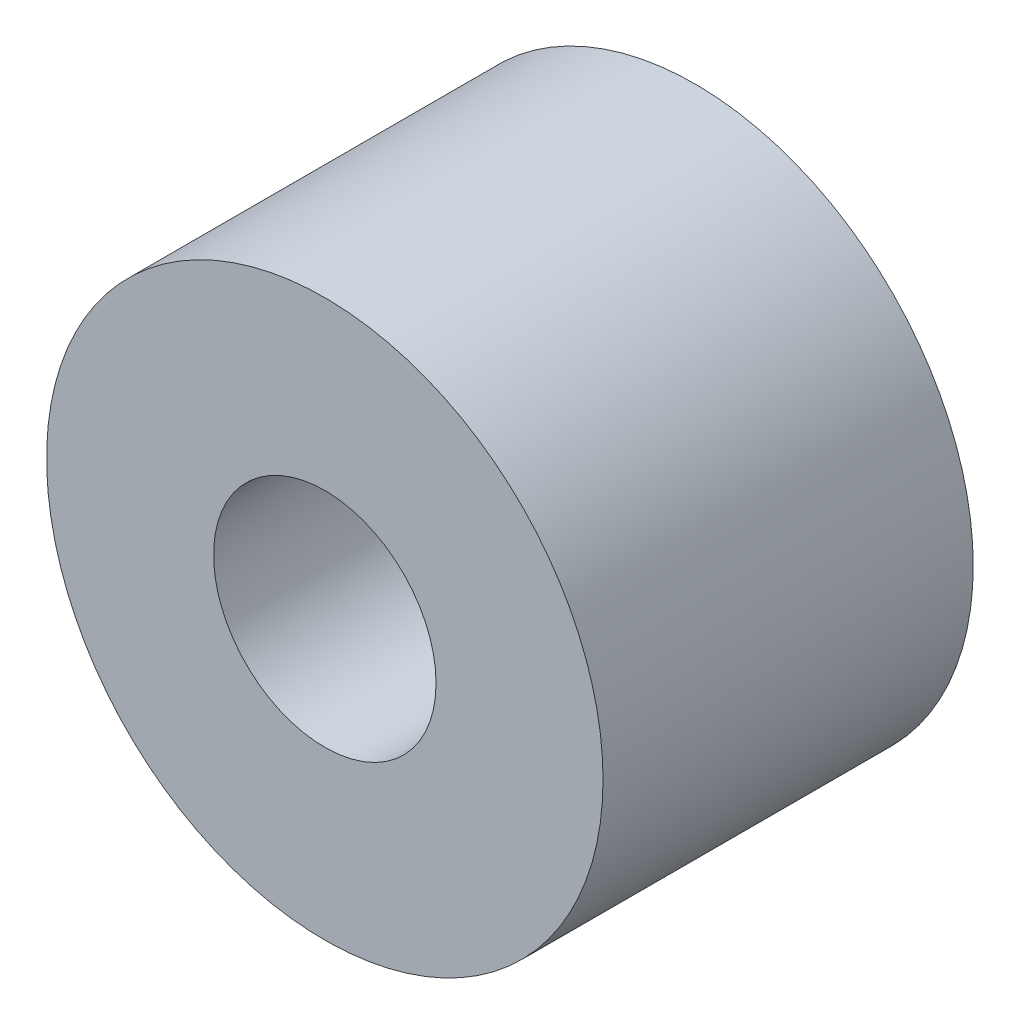
ISO-10303-21;
HEADER;
FILE_DESCRIPTION(('STEP AP214'),'2;1');
FILE_NAME('part.step','',(''),(''),'','','');
FILE_SCHEMA(('AUTOMOTIVE_DESIGN { 1 0 10303 214 1 1 1 1 }'));
ENDSEC;
DATA;
#1=APPLICATION_CONTEXT('core data for automotive mechanical design processes');
#2=APPLICATION_PROTOCOL_DEFINITION('international standard','automotive_design',2000,#1);
#3=PRODUCT_CONTEXT('',#1,'mechanical');
#4=PRODUCT('Part','Part','',(#3));
#5=PRODUCT_RELATED_PRODUCT_CATEGORY('part','',(#4));
#6=PRODUCT_DEFINITION_FORMATION('','',#4);
#7=PRODUCT_DEFINITION_CONTEXT('part definition',#1,'design');
#8=PRODUCT_DEFINITION('design','',#6,#7);
#9=PRODUCT_DEFINITION_SHAPE('','',#8);
#10=(LENGTH_UNIT() NAMED_UNIT(*) SI_UNIT(.MILLI.,.METRE.));
#11=(NAMED_UNIT(*) PLANE_ANGLE_UNIT() SI_UNIT($,.RADIAN.));
#12=(NAMED_UNIT(*) SI_UNIT($,.STERADIAN.) SOLID_ANGLE_UNIT());
#13=UNCERTAINTY_MEASURE_WITH_UNIT(LENGTH_MEASURE(1.E-05),#10,'distance_accuracy_value','');
#14=(GEOMETRIC_REPRESENTATION_CONTEXT(3) GLOBAL_UNCERTAINTY_ASSIGNED_CONTEXT((#13)) GLOBAL_UNIT_ASSIGNED_CONTEXT((#10,
#11,#12)) REPRESENTATION_CONTEXT('',''));
#15=CARTESIAN_POINT('',(0.,0.,0.));
#16=DIRECTION('',(0.,0.,1.));
#17=DIRECTION('',(1.,0.,0.));
#18=AXIS2_PLACEMENT_3D('',#15,#16,#17);
#19=CARTESIAN_POINT('',(0.,0.,1268.));
#20=DIRECTION('',(0.,0.,1.));
#21=DIRECTION('',(1.,0.,0.));
#22=AXIS2_PLACEMENT_3D('',#19,#20,#21);
#23=PLANE('',#22);
#24=CARTESIAN_POINT('',(0.,0.,1268.));
#25=DIRECTION('',(0.,0.,1.));
#26=DIRECTION('',(1.,0.,0.));
#27=AXIS2_PLACEMENT_3D('',#24,#25,#26);
#28=CIRCLE('',#27,953.);
#29=CARTESIAN_POINT('',(953.,0.,1268.));
#30=VERTEX_POINT('',#29);
#31=EDGE_CURVE('E11',#30,#30,#28,.T.);
#32=ORIENTED_EDGE('',*,*,#31,.T.);
#33=EDGE_LOOP('',(#32));
#34=FACE_BOUND('',#33,.T.);
#35=CARTESIAN_POINT('',(0.,0.,1268.));
#36=DIRECTION('',(0.,0.,1.));
#37=DIRECTION('',(1.,0.,0.));
#38=AXIS2_PLACEMENT_3D('',#35,#36,#37);
#39=CIRCLE('',#38,381.);
#40=CARTESIAN_POINT('',(381.,0.,1268.));
#41=VERTEX_POINT('',#40);
#42=EDGE_CURVE('E56',#41,#41,#39,.T.);
#43=ORIENTED_EDGE('',*,*,#42,.F.);
#44=EDGE_LOOP('',(#43));
#45=FACE_BOUND('',#44,.T.);
#46=ADVANCED_FACE('F45',(#34,#45),#23,.T.);
#47=CARTESIAN_POINT('',(0.,0.,0.));
#48=DIRECTION('',(0.,0.,1.));
#49=DIRECTION('',(1.,0.,0.));
#50=AXIS2_PLACEMENT_3D('',#47,#48,#49);
#51=PLANE('',#50);
#52=CARTESIAN_POINT('',(0.,0.,0.));
#53=DIRECTION('',(0.,0.,1.));
#54=DIRECTION('',(1.,0.,0.));
#55=AXIS2_PLACEMENT_3D('',#52,#53,#54);
#56=CIRCLE('',#55,953.);
#57=CARTESIAN_POINT('',(953.,0.,0.));
#58=VERTEX_POINT('',#57);
#59=EDGE_CURVE('E49',#58,#58,#56,.T.);
#60=ORIENTED_EDGE('',*,*,#59,.F.);
#61=EDGE_LOOP('',(#60));
#62=FACE_BOUND('',#61,.T.);
#63=CARTESIAN_POINT('',(0.,0.,0.));
#64=DIRECTION('',(0.,0.,1.));
#65=DIRECTION('',(1.,0.,0.));
#66=AXIS2_PLACEMENT_3D('',#63,#64,#65);
#67=CIRCLE('',#66,381.);
#68=CARTESIAN_POINT('',(381.,0.,0.));
#69=VERTEX_POINT('',#68);
#70=EDGE_CURVE('E58',#69,#69,#67,.T.);
#71=ORIENTED_EDGE('',*,*,#70,.T.);
#72=EDGE_LOOP('',(#71));
#73=FACE_BOUND('',#72,.T.);
#74=ADVANCED_FACE('F68',(#62,#73),#51,.F.);
#75=CARTESIAN_POINT('',(0.,0.,1268.));
#76=DIRECTION('',(0.,0.,-1.));
#77=DIRECTION('',(-1.,0.,0.));
#78=AXIS2_PLACEMENT_3D('',#75,#76,#77);
#79=CYLINDRICAL_SURFACE('',#78,953.);
#80=ORIENTED_EDGE('',*,*,#31,.F.);
#81=EDGE_LOOP('',(#80));
#82=FACE_BOUND('',#81,.T.);
#83=ORIENTED_EDGE('',*,*,#59,.T.);
#84=EDGE_LOOP('',(#83));
#85=FACE_BOUND('',#84,.T.);
#86=ADVANCED_FACE('F47',(#82,#85),#79,.T.);
#87=CARTESIAN_POINT('',(0.,0.,1268.));
#88=DIRECTION('',(0.,0.,-1.));
#89=DIRECTION('',(-1.,0.,0.));
#90=AXIS2_PLACEMENT_3D('',#87,#88,#89);
#91=CYLINDRICAL_SURFACE('',#90,381.);
#92=ORIENTED_EDGE('',*,*,#42,.T.);
#93=EDGE_LOOP('',(#92));
#94=FACE_BOUND('',#93,.T.);
#95=ORIENTED_EDGE('',*,*,#70,.F.);
#96=EDGE_LOOP('',(#95));
#97=FACE_BOUND('',#96,.T.);
#98=ADVANCED_FACE('F64',(#94,#97),#91,.F.);
#99=CLOSED_SHELL('',(#46,#74,#86,#98));
#100=MANIFOLD_SOLID_BREP('B2',#99);
#101=ADVANCED_BREP_SHAPE_REPRESENTATION('',(#18,#100),#14);
#102=SHAPE_DEFINITION_REPRESENTATION(#9,#101);
ENDSEC;
END-ISO-10303-21;
